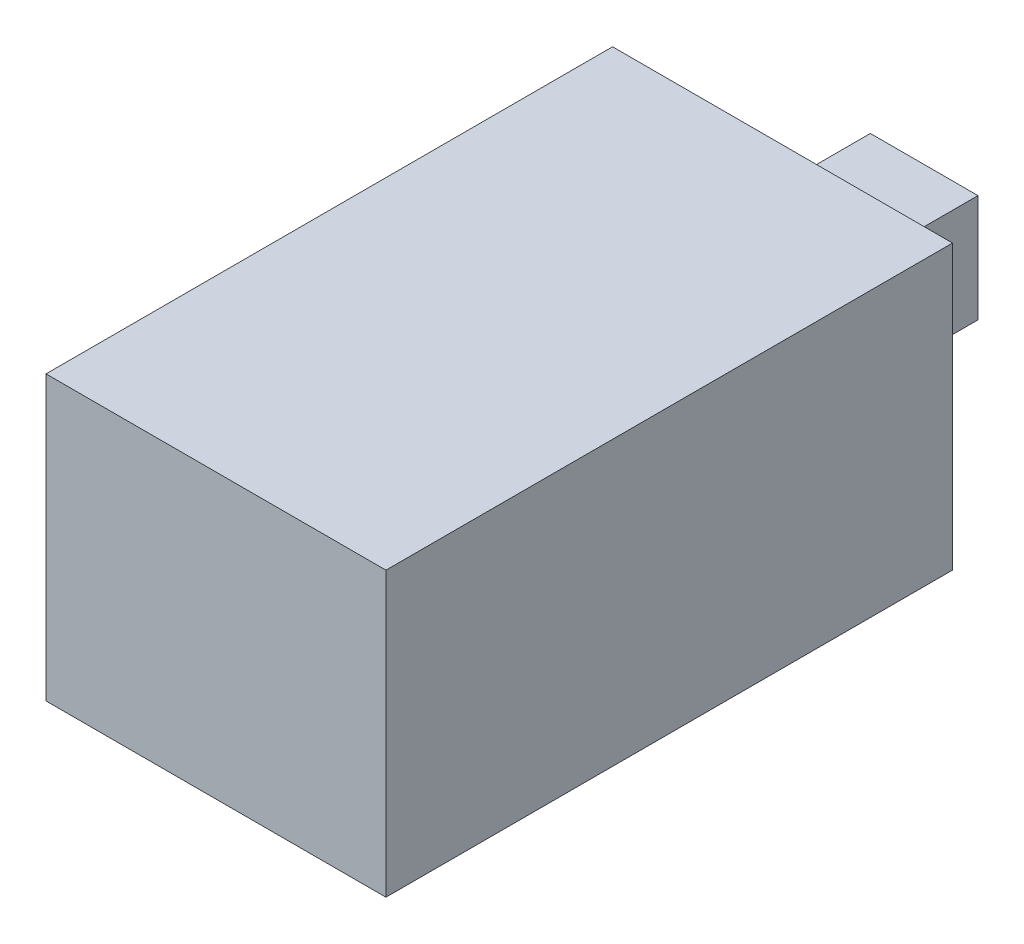
ISO-10303-21;
HEADER;
FILE_DESCRIPTION(('STEP AP214'),'2;1');
FILE_NAME('part.step','',(''),(''),'','','');
FILE_SCHEMA(('AUTOMOTIVE_DESIGN { 1 0 10303 214 1 1 1 1 }'));
ENDSEC;
DATA;
#1=APPLICATION_CONTEXT('core data for automotive mechanical design processes');
#2=APPLICATION_PROTOCOL_DEFINITION('international standard','automotive_design',2000,#1);
#3=PRODUCT_CONTEXT('',#1,'mechanical');
#4=PRODUCT('Part','Part','',(#3));
#5=PRODUCT_RELATED_PRODUCT_CATEGORY('part','',(#4));
#6=PRODUCT_DEFINITION_FORMATION('','',#4);
#7=PRODUCT_DEFINITION_CONTEXT('part definition',#1,'design');
#8=PRODUCT_DEFINITION('design','',#6,#7);
#9=PRODUCT_DEFINITION_SHAPE('','',#8);
#10=(LENGTH_UNIT() NAMED_UNIT(*) SI_UNIT(.MILLI.,.METRE.));
#11=(NAMED_UNIT(*) PLANE_ANGLE_UNIT() SI_UNIT($,.RADIAN.));
#12=(NAMED_UNIT(*) SI_UNIT($,.STERADIAN.) SOLID_ANGLE_UNIT());
#13=UNCERTAINTY_MEASURE_WITH_UNIT(LENGTH_MEASURE(1.E-05),#10,'distance_accuracy_value','');
#14=(GEOMETRIC_REPRESENTATION_CONTEXT(3) GLOBAL_UNCERTAINTY_ASSIGNED_CONTEXT((#13)) GLOBAL_UNIT_ASSIGNED_CONTEXT((#10,
#11,#12)) REPRESENTATION_CONTEXT('',''));
#15=CARTESIAN_POINT('',(0.,0.,0.));
#16=DIRECTION('',(0.,0.,1.));
#17=DIRECTION('',(1.,0.,0.));
#18=AXIS2_PLACEMENT_3D('',#15,#16,#17);
#19=CARTESIAN_POINT('',(6.,-5.,20.));
#20=DIRECTION('',(-1.,0.,0.));
#21=DIRECTION('',(0.,0.,1.));
#22=AXIS2_PLACEMENT_3D('',#19,#20,#21);
#23=PLANE('',#22);
#24=DIRECTION('',(0.,1.,0.));
#25=VECTOR('',#24,1.);
#26=CARTESIAN_POINT('',(6.,-5.,0.));
#27=LINE('',#26,#25);
#28=CARTESIAN_POINT('',(6.,-5.,0.));
#29=VERTEX_POINT('',#28);
#30=CARTESIAN_POINT('',(6.,5.,0.));
#31=VERTEX_POINT('',#30);
#32=EDGE_CURVE('E119',#29,#31,#27,.T.);
#33=ORIENTED_EDGE('',*,*,#32,.T.);
#34=DIRECTION('',(0.,0.,-1.));
#35=VECTOR('',#34,1.);
#36=CARTESIAN_POINT('',(6.,5.,20.));
#37=LINE('',#36,#35);
#38=CARTESIAN_POINT('',(6.,5.,20.));
#39=VERTEX_POINT('',#38);
#40=EDGE_CURVE('E11',#39,#31,#37,.T.);
#41=ORIENTED_EDGE('',*,*,#40,.F.);
#42=DIRECTION('',(0.,1.,0.));
#43=VECTOR('',#42,1.);
#44=CARTESIAN_POINT('',(6.,-5.,20.));
#45=LINE('',#44,#43);
#46=CARTESIAN_POINT('',(6.,-5.,20.));
#47=VERTEX_POINT('',#46);
#48=EDGE_CURVE('E128',#47,#39,#45,.T.);
#49=ORIENTED_EDGE('',*,*,#48,.F.);
#50=DIRECTION('',(0.,0.,-1.));
#51=VECTOR('',#50,1.);
#52=CARTESIAN_POINT('',(6.,-5.,20.));
#53=LINE('',#52,#51);
#54=EDGE_CURVE('E137',#47,#29,#53,.T.);
#55=ORIENTED_EDGE('',*,*,#54,.T.);
#56=EDGE_LOOP('',(#33,#41,#49,#55));
#57=FACE_BOUND('',#56,.T.);
#58=ADVANCED_FACE('F35',(#57),#23,.F.);
#59=CARTESIAN_POINT('',(-6.,5.,20.));
#60=DIRECTION('',(0.,-1.,0.));
#61=DIRECTION('',(0.,0.,-1.));
#62=AXIS2_PLACEMENT_3D('',#59,#60,#61);
#63=PLANE('',#62);
#64=DIRECTION('',(-1.,0.,0.));
#65=VECTOR('',#64,1.);
#66=CARTESIAN_POINT('',(-6.,5.,0.));
#67=LINE('',#66,#65);
#68=CARTESIAN_POINT('',(-6.,5.,0.));
#69=VERTEX_POINT('',#68);
#70=EDGE_CURVE('E122',#31,#69,#67,.T.);
#71=ORIENTED_EDGE('',*,*,#70,.T.);
#72=DIRECTION('',(0.,0.,-1.));
#73=VECTOR('',#72,1.);
#74=CARTESIAN_POINT('',(-6.,5.,20.));
#75=LINE('',#74,#73);
#76=CARTESIAN_POINT('',(-6.,5.,20.));
#77=VERTEX_POINT('',#76);
#78=EDGE_CURVE('E42',#77,#69,#75,.T.);
#79=ORIENTED_EDGE('',*,*,#78,.F.);
#80=DIRECTION('',(-1.,0.,0.));
#81=VECTOR('',#80,1.);
#82=CARTESIAN_POINT('',(-6.,5.,20.));
#83=LINE('',#82,#81);
#84=EDGE_CURVE('E131',#39,#77,#83,.T.);
#85=ORIENTED_EDGE('',*,*,#84,.F.);
#86=ORIENTED_EDGE('',*,*,#40,.T.);
#87=EDGE_LOOP('',(#71,#79,#85,#86));
#88=FACE_BOUND('',#87,.T.);
#89=ADVANCED_FACE('F168',(#88),#63,.F.);
#90=CARTESIAN_POINT('',(-6.,-5.,20.));
#91=DIRECTION('',(1.,0.,0.));
#92=DIRECTION('',(0.,0.,-1.));
#93=AXIS2_PLACEMENT_3D('',#90,#91,#92);
#94=PLANE('',#93);
#95=DIRECTION('',(0.,-1.,0.));
#96=VECTOR('',#95,1.);
#97=CARTESIAN_POINT('',(-6.,-5.,0.));
#98=LINE('',#97,#96);
#99=CARTESIAN_POINT('',(-6.,-5.,0.));
#100=VERTEX_POINT('',#99);
#101=EDGE_CURVE('E140',#69,#100,#98,.T.);
#102=ORIENTED_EDGE('',*,*,#101,.T.);
#103=DIRECTION('',(0.,0.,-1.));
#104=VECTOR('',#103,1.);
#105=CARTESIAN_POINT('',(-6.,-5.,20.));
#106=LINE('',#105,#104);
#107=CARTESIAN_POINT('',(-6.,-5.,20.));
#108=VERTEX_POINT('',#107);
#109=EDGE_CURVE('E145',#108,#100,#106,.T.);
#110=ORIENTED_EDGE('',*,*,#109,.F.);
#111=DIRECTION('',(0.,-1.,0.));
#112=VECTOR('',#111,1.);
#113=CARTESIAN_POINT('',(-6.,-5.,20.));
#114=LINE('',#113,#112);
#115=EDGE_CURVE('E134',#77,#108,#114,.T.);
#116=ORIENTED_EDGE('',*,*,#115,.F.);
#117=ORIENTED_EDGE('',*,*,#78,.T.);
#118=EDGE_LOOP('',(#102,#110,#116,#117));
#119=FACE_BOUND('',#118,.T.);
#120=ADVANCED_FACE('F152',(#119),#94,.F.);
#121=CARTESIAN_POINT('',(-6.,-5.,20.));
#122=DIRECTION('',(0.,1.,0.));
#123=DIRECTION('',(0.,0.,1.));
#124=AXIS2_PLACEMENT_3D('',#121,#122,#123);
#125=PLANE('',#124);
#126=DIRECTION('',(1.,0.,0.));
#127=VECTOR('',#126,1.);
#128=CARTESIAN_POINT('',(-6.,-5.,0.));
#129=LINE('',#128,#127);
#130=EDGE_CURVE('E132',#100,#29,#129,.T.);
#131=ORIENTED_EDGE('',*,*,#130,.T.);
#132=ORIENTED_EDGE('',*,*,#54,.F.);
#133=DIRECTION('',(1.,0.,0.));
#134=VECTOR('',#133,1.);
#135=CARTESIAN_POINT('',(-6.,-5.,20.));
#136=LINE('',#135,#134);
#137=EDGE_CURVE('E136',#108,#47,#136,.T.);
#138=ORIENTED_EDGE('',*,*,#137,.F.);
#139=ORIENTED_EDGE('',*,*,#109,.T.);
#140=EDGE_LOOP('',(#131,#132,#138,#139));
#141=FACE_BOUND('',#140,.T.);
#142=ADVANCED_FACE('F161',(#141),#125,.F.);
#143=CARTESIAN_POINT('',(0.,0.,20.));
#144=DIRECTION('',(0.,0.,-1.));
#145=DIRECTION('',(-1.,0.,0.));
#146=AXIS2_PLACEMENT_3D('',#143,#144,#145);
#147=PLANE('',#146);
#148=ORIENTED_EDGE('',*,*,#48,.T.);
#149=ORIENTED_EDGE('',*,*,#84,.T.);
#150=ORIENTED_EDGE('',*,*,#115,.T.);
#151=ORIENTED_EDGE('',*,*,#137,.T.);
#152=EDGE_LOOP('',(#148,#149,#150,#151));
#153=FACE_BOUND('',#152,.T.);
#154=ADVANCED_FACE('F167',(#153),#147,.F.);
#155=CARTESIAN_POINT('',(0.,0.,0.));
#156=DIRECTION('',(0.,0.,-1.));
#157=DIRECTION('',(-1.,0.,0.));
#158=AXIS2_PLACEMENT_3D('',#155,#156,#157);
#159=PLANE('',#158);
#160=DIRECTION('',(0.,-1.,0.));
#161=VECTOR('',#160,1.);
#162=CARTESIAN_POINT('',(1.9,-1.9,0.));
#163=LINE('',#162,#161);
#164=CARTESIAN_POINT('',(1.9,1.9,0.));
#165=VERTEX_POINT('',#164);
#166=CARTESIAN_POINT('',(1.9,-1.9,0.));
#167=VERTEX_POINT('',#166);
#168=EDGE_CURVE('E49',#165,#167,#163,.T.);
#169=ORIENTED_EDGE('',*,*,#168,.F.);
#170=DIRECTION('',(1.,0.,0.));
#171=VECTOR('',#170,1.);
#172=CARTESIAN_POINT('',(-1.9,1.9,0.));
#173=LINE('',#172,#171);
#174=CARTESIAN_POINT('',(-1.9,1.9,0.));
#175=VERTEX_POINT('',#174);
#176=EDGE_CURVE('E53',#175,#165,#173,.T.);
#177=ORIENTED_EDGE('',*,*,#176,.F.);
#178=DIRECTION('',(0.,1.,0.));
#179=VECTOR('',#178,1.);
#180=CARTESIAN_POINT('',(-1.9,-1.9,0.));
#181=LINE('',#180,#179);
#182=CARTESIAN_POINT('',(-1.9,-1.9,0.));
#183=VERTEX_POINT('',#182);
#184=EDGE_CURVE('E262',#183,#175,#181,.T.);
#185=ORIENTED_EDGE('',*,*,#184,.F.);
#186=DIRECTION('',(-1.,0.,0.));
#187=VECTOR('',#186,1.);
#188=CARTESIAN_POINT('',(-1.9,-1.9,0.));
#189=LINE('',#188,#187);
#190=EDGE_CURVE('E268',#167,#183,#189,.T.);
#191=ORIENTED_EDGE('',*,*,#190,.F.);
#192=EDGE_LOOP('',(#169,#177,#185,#191));
#193=FACE_BOUND('',#192,.T.);
#194=ORIENTED_EDGE('',*,*,#32,.F.);
#195=ORIENTED_EDGE('',*,*,#130,.F.);
#196=ORIENTED_EDGE('',*,*,#101,.F.);
#197=ORIENTED_EDGE('',*,*,#70,.F.);
#198=EDGE_LOOP('',(#194,#195,#196,#197));
#199=FACE_BOUND('',#198,.T.);
#200=ADVANCED_FACE('F158',(#193,#199),#159,.T.);
#201=CARTESIAN_POINT('',(1.9,-1.9,-5.));
#202=DIRECTION('',(-1.,0.,0.));
#203=DIRECTION('',(0.,0.,1.));
#204=AXIS2_PLACEMENT_3D('',#201,#202,#203);
#205=PLANE('',#204);
#206=ORIENTED_EDGE('',*,*,#168,.T.);
#207=DIRECTION('',(0.,0.,1.));
#208=VECTOR('',#207,1.);
#209=CARTESIAN_POINT('',(1.9,-1.9,-5.));
#210=LINE('',#209,#208);
#211=CARTESIAN_POINT('',(1.9,-1.9,-5.));
#212=VERTEX_POINT('',#211);
#213=EDGE_CURVE('E102',#212,#167,#210,.T.);
#214=ORIENTED_EDGE('',*,*,#213,.F.);
#215=DIRECTION('',(0.,-1.,0.));
#216=VECTOR('',#215,1.);
#217=CARTESIAN_POINT('',(1.9,-1.9,-5.));
#218=LINE('',#217,#216);
#219=CARTESIAN_POINT('',(1.9,1.9,-5.));
#220=VERTEX_POINT('',#219);
#221=EDGE_CURVE('E108',#220,#212,#218,.T.);
#222=ORIENTED_EDGE('',*,*,#221,.F.);
#223=DIRECTION('',(0.,0.,1.));
#224=VECTOR('',#223,1.);
#225=CARTESIAN_POINT('',(1.9,1.9,-5.));
#226=LINE('',#225,#224);
#227=EDGE_CURVE('E260',#220,#165,#226,.T.);
#228=ORIENTED_EDGE('',*,*,#227,.T.);
#229=EDGE_LOOP('',(#206,#214,#222,#228));
#230=FACE_BOUND('',#229,.T.);
#231=ADVANCED_FACE('F118',(#230),#205,.F.);
#232=CARTESIAN_POINT('',(-1.9,-1.9,-5.));
#233=DIRECTION('',(0.,1.,0.));
#234=DIRECTION('',(-1.,0.,0.));
#235=AXIS2_PLACEMENT_3D('',#232,#233,#234);
#236=PLANE('',#235);
#237=ORIENTED_EDGE('',*,*,#190,.T.);
#238=DIRECTION('',(0.,0.,1.));
#239=VECTOR('',#238,1.);
#240=CARTESIAN_POINT('',(-1.9,-1.9,-5.));
#241=LINE('',#240,#239);
#242=CARTESIAN_POINT('',(-1.9,-1.9,-5.));
#243=VERTEX_POINT('',#242);
#244=EDGE_CURVE('E104',#243,#183,#241,.T.);
#245=ORIENTED_EDGE('',*,*,#244,.F.);
#246=DIRECTION('',(-1.,0.,0.));
#247=VECTOR('',#246,1.);
#248=CARTESIAN_POINT('',(-1.9,-1.9,-5.));
#249=LINE('',#248,#247);
#250=EDGE_CURVE('E97',#212,#243,#249,.T.);
#251=ORIENTED_EDGE('',*,*,#250,.F.);
#252=ORIENTED_EDGE('',*,*,#213,.T.);
#253=EDGE_LOOP('',(#237,#245,#251,#252));
#254=FACE_BOUND('',#253,.T.);
#255=ADVANCED_FACE('F100',(#254),#236,.F.);
#256=CARTESIAN_POINT('',(-1.9,-1.9,-5.));
#257=DIRECTION('',(1.,0.,0.));
#258=DIRECTION('',(0.,0.,-1.));
#259=AXIS2_PLACEMENT_3D('',#256,#257,#258);
#260=PLANE('',#259);
#261=ORIENTED_EDGE('',*,*,#184,.T.);
#262=DIRECTION('',(0.,0.,1.));
#263=VECTOR('',#262,1.);
#264=CARTESIAN_POINT('',(-1.9,1.9,-5.));
#265=LINE('',#264,#263);
#266=CARTESIAN_POINT('',(-1.9,1.9,-5.));
#267=VERTEX_POINT('',#266);
#268=EDGE_CURVE('E124',#267,#175,#265,.T.);
#269=ORIENTED_EDGE('',*,*,#268,.F.);
#270=DIRECTION('',(0.,1.,0.));
#271=VECTOR('',#270,1.);
#272=CARTESIAN_POINT('',(-1.9,-1.9,-5.));
#273=LINE('',#272,#271);
#274=EDGE_CURVE('E107',#243,#267,#273,.T.);
#275=ORIENTED_EDGE('',*,*,#274,.F.);
#276=ORIENTED_EDGE('',*,*,#244,.T.);
#277=EDGE_LOOP('',(#261,#269,#275,#276));
#278=FACE_BOUND('',#277,.T.);
#279=ADVANCED_FACE('F186',(#278),#260,.F.);
#280=CARTESIAN_POINT('',(-1.9,1.9,-5.));
#281=DIRECTION('',(0.,-1.,0.));
#282=DIRECTION('',(1.,0.,0.));
#283=AXIS2_PLACEMENT_3D('',#280,#281,#282);
#284=PLANE('',#283);
#285=ORIENTED_EDGE('',*,*,#176,.T.);
#286=ORIENTED_EDGE('',*,*,#227,.F.);
#287=DIRECTION('',(1.,0.,0.));
#288=VECTOR('',#287,1.);
#289=CARTESIAN_POINT('',(-1.9,1.9,-5.));
#290=LINE('',#289,#288);
#291=EDGE_CURVE('E113',#267,#220,#290,.T.);
#292=ORIENTED_EDGE('',*,*,#291,.F.);
#293=ORIENTED_EDGE('',*,*,#268,.T.);
#294=EDGE_LOOP('',(#285,#286,#292,#293));
#295=FACE_BOUND('',#294,.T.);
#296=ADVANCED_FACE('F189',(#295),#284,.F.);
#297=CARTESIAN_POINT('',(0.,0.,-5.));
#298=DIRECTION('',(0.,0.,-1.));
#299=DIRECTION('',(-1.,0.,0.));
#300=AXIS2_PLACEMENT_3D('',#297,#298,#299);
#301=PLANE('',#300);
#302=ORIENTED_EDGE('',*,*,#221,.T.);
#303=ORIENTED_EDGE('',*,*,#250,.T.);
#304=ORIENTED_EDGE('',*,*,#274,.T.);
#305=ORIENTED_EDGE('',*,*,#291,.T.);
#306=EDGE_LOOP('',(#302,#303,#304,#305));
#307=FACE_BOUND('',#306,.T.);
#308=ADVANCED_FACE('F111',(#307),#301,.T.);
#309=CLOSED_SHELL('',(#58,#89,#120,#142,#154,#200,#231,#255,#279,#296,#308));
#310=MANIFOLD_SOLID_BREP('B2',#309);
#311=ADVANCED_BREP_SHAPE_REPRESENTATION('',(#18,#310),#14);
#312=SHAPE_DEFINITION_REPRESENTATION(#9,#311);
ENDSEC;
END-ISO-10303-21;
